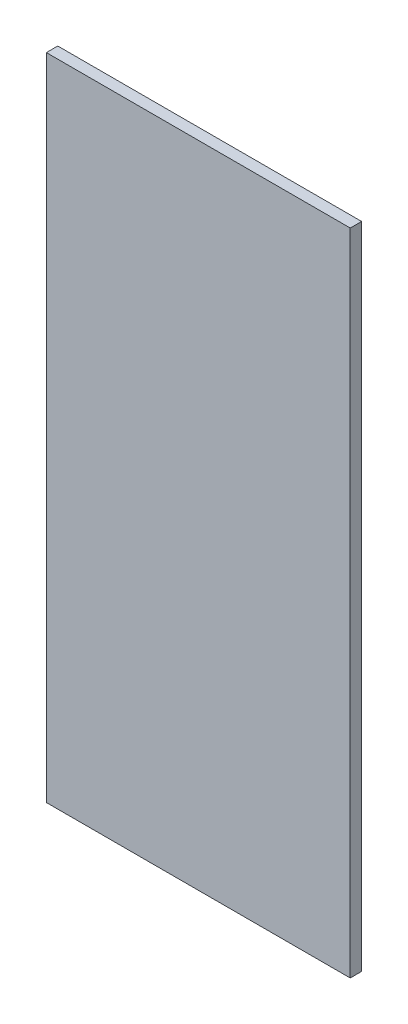
ISO-10303-21;
HEADER;
FILE_DESCRIPTION(('STEP AP214'),'2;1');
FILE_NAME('part.step','',(''),(''),'','','');
FILE_SCHEMA(('AUTOMOTIVE_DESIGN { 1 0 10303 214 1 1 1 1 }'));
ENDSEC;
DATA;
#1=APPLICATION_CONTEXT('core data for automotive mechanical design processes');
#2=APPLICATION_PROTOCOL_DEFINITION('international standard','automotive_design',2000,#1);
#3=PRODUCT_CONTEXT('',#1,'mechanical');
#4=PRODUCT('Part','Part','',(#3));
#5=PRODUCT_RELATED_PRODUCT_CATEGORY('part','',(#4));
#6=PRODUCT_DEFINITION_FORMATION('','',#4);
#7=PRODUCT_DEFINITION_CONTEXT('part definition',#1,'design');
#8=PRODUCT_DEFINITION('design','',#6,#7);
#9=PRODUCT_DEFINITION_SHAPE('','',#8);
#10=(LENGTH_UNIT() NAMED_UNIT(*) SI_UNIT(.MILLI.,.METRE.));
#11=(NAMED_UNIT(*) PLANE_ANGLE_UNIT() SI_UNIT($,.RADIAN.));
#12=(NAMED_UNIT(*) SI_UNIT($,.STERADIAN.) SOLID_ANGLE_UNIT());
#13=UNCERTAINTY_MEASURE_WITH_UNIT(LENGTH_MEASURE(1.E-05),#10,'distance_accuracy_value','');
#14=(GEOMETRIC_REPRESENTATION_CONTEXT(3) GLOBAL_UNCERTAINTY_ASSIGNED_CONTEXT((#13)) GLOBAL_UNIT_ASSIGNED_CONTEXT((#10,
#11,#12)) REPRESENTATION_CONTEXT('',''));
#15=CARTESIAN_POINT('',(0.,0.,0.));
#16=DIRECTION('',(0.,0.,1.));
#17=DIRECTION('',(1.,0.,0.));
#18=AXIS2_PLACEMENT_3D('',#15,#16,#17);
#19=CARTESIAN_POINT('',(-33.3720930232558,26.7441860465116,3.));
#20=DIRECTION('',(1.,0.,0.));
#21=DIRECTION('',(0.,1.,0.));
#22=AXIS2_PLACEMENT_3D('',#19,#20,#21);
#23=PLANE('',#22);
#24=DIRECTION('',(0.,-1.,0.));
#25=VECTOR('',#24,1.);
#26=CARTESIAN_POINT('',(-33.3720930232558,26.7441860465116,0.));
#27=LINE('',#26,#25);
#28=CARTESIAN_POINT('',(-33.3720930232558,26.7441860465116,0.));
#29=VERTEX_POINT('',#28);
#30=CARTESIAN_POINT('',(-33.3720930232558,-144.255813953488,0.));
#31=VERTEX_POINT('',#30);
#32=EDGE_CURVE('E107',#29,#31,#27,.T.);
#33=ORIENTED_EDGE('',*,*,#32,.T.);
#34=DIRECTION('',(0.,0.,-1.));
#35=VECTOR('',#34,1.);
#36=CARTESIAN_POINT('',(-33.3720930232558,-144.255813953488,3.));
#37=LINE('',#36,#35);
#38=CARTESIAN_POINT('',(-33.3720930232558,-144.255813953488,3.));
#39=VERTEX_POINT('',#38);
#40=EDGE_CURVE('E11',#39,#31,#37,.T.);
#41=ORIENTED_EDGE('',*,*,#40,.F.);
#42=DIRECTION('',(0.,-1.,0.));
#43=VECTOR('',#42,1.);
#44=CARTESIAN_POINT('',(-33.3720930232558,26.7441860465116,3.));
#45=LINE('',#44,#43);
#46=CARTESIAN_POINT('',(-33.3720930232558,26.7441860465116,3.));
#47=VERTEX_POINT('',#46);
#48=EDGE_CURVE('E91',#47,#39,#45,.T.);
#49=ORIENTED_EDGE('',*,*,#48,.F.);
#50=DIRECTION('',(0.,0.,-1.));
#51=VECTOR('',#50,1.);
#52=CARTESIAN_POINT('',(-33.3720930232558,26.7441860465116,3.));
#53=LINE('',#52,#51);
#54=EDGE_CURVE('E103',#47,#29,#53,.T.);
#55=ORIENTED_EDGE('',*,*,#54,.T.);
#56=EDGE_LOOP('',(#33,#41,#49,#55));
#57=FACE_BOUND('',#56,.T.);
#58=ADVANCED_FACE('F39',(#57),#23,.F.);
#59=CARTESIAN_POINT('',(-33.3720930232558,-144.255813953488,3.));
#60=DIRECTION('',(0.,1.,0.));
#61=DIRECTION('',(0.,0.,1.));
#62=AXIS2_PLACEMENT_3D('',#59,#60,#61);
#63=PLANE('',#62);
#64=DIRECTION('',(1.,0.,0.));
#65=VECTOR('',#64,1.);
#66=CARTESIAN_POINT('',(-33.3720930232558,-144.255813953488,0.));
#67=LINE('',#66,#65);
#68=CARTESIAN_POINT('',(46.6279069767442,-144.255813953488,0.));
#69=VERTEX_POINT('',#68);
#70=EDGE_CURVE('E96',#31,#69,#67,.T.);
#71=ORIENTED_EDGE('',*,*,#70,.T.);
#72=DIRECTION('',(0.,0.,-1.));
#73=VECTOR('',#72,1.);
#74=CARTESIAN_POINT('',(46.6279069767442,-144.255813953488,3.));
#75=LINE('',#74,#73);
#76=CARTESIAN_POINT('',(46.6279069767442,-144.255813953488,3.));
#77=VERTEX_POINT('',#76);
#78=EDGE_CURVE('E48',#77,#69,#75,.T.);
#79=ORIENTED_EDGE('',*,*,#78,.F.);
#80=DIRECTION('',(1.,0.,0.));
#81=VECTOR('',#80,1.);
#82=CARTESIAN_POINT('',(-33.3720930232558,-144.255813953488,3.));
#83=LINE('',#82,#81);
#84=EDGE_CURVE('E86',#39,#77,#83,.T.);
#85=ORIENTED_EDGE('',*,*,#84,.F.);
#86=ORIENTED_EDGE('',*,*,#40,.T.);
#87=EDGE_LOOP('',(#71,#79,#85,#86));
#88=FACE_BOUND('',#87,.T.);
#89=ADVANCED_FACE('F95',(#88),#63,.F.);
#90=CARTESIAN_POINT('',(46.6279069767442,26.7441860465116,3.));
#91=DIRECTION('',(-1.,0.,0.));
#92=DIRECTION('',(0.,-1.,0.));
#93=AXIS2_PLACEMENT_3D('',#90,#91,#92);
#94=PLANE('',#93);
#95=DIRECTION('',(0.,1.,0.));
#96=VECTOR('',#95,1.);
#97=CARTESIAN_POINT('',(46.6279069767442,26.7441860465116,0.));
#98=LINE('',#97,#96);
#99=CARTESIAN_POINT('',(46.6279069767442,26.7441860465116,0.));
#100=VERTEX_POINT('',#99);
#101=EDGE_CURVE('E73',#69,#100,#98,.T.);
#102=ORIENTED_EDGE('',*,*,#101,.T.);
#103=DIRECTION('',(0.,0.,-1.));
#104=VECTOR('',#103,1.);
#105=CARTESIAN_POINT('',(46.6279069767442,26.7441860465116,3.));
#106=LINE('',#105,#104);
#107=CARTESIAN_POINT('',(46.6279069767442,26.7441860465116,3.));
#108=VERTEX_POINT('',#107);
#109=EDGE_CURVE('E98',#108,#100,#106,.T.);
#110=ORIENTED_EDGE('',*,*,#109,.F.);
#111=DIRECTION('',(0.,1.,0.));
#112=VECTOR('',#111,1.);
#113=CARTESIAN_POINT('',(46.6279069767442,26.7441860465116,3.));
#114=LINE('',#113,#112);
#115=EDGE_CURVE('E89',#77,#108,#114,.T.);
#116=ORIENTED_EDGE('',*,*,#115,.F.);
#117=ORIENTED_EDGE('',*,*,#78,.T.);
#118=EDGE_LOOP('',(#102,#110,#116,#117));
#119=FACE_BOUND('',#118,.T.);
#120=ADVANCED_FACE('F99',(#119),#94,.F.);
#121=CARTESIAN_POINT('',(-33.3720930232558,26.7441860465116,3.));
#122=DIRECTION('',(0.,-1.,0.));
#123=DIRECTION('',(0.,0.,-1.));
#124=AXIS2_PLACEMENT_3D('',#121,#122,#123);
#125=PLANE('',#124);
#126=DIRECTION('',(-1.,0.,0.));
#127=VECTOR('',#126,1.);
#128=CARTESIAN_POINT('',(-33.3720930232558,26.7441860465116,0.));
#129=LINE('',#128,#127);
#130=EDGE_CURVE('E79',#100,#29,#129,.T.);
#131=ORIENTED_EDGE('',*,*,#130,.T.);
#132=ORIENTED_EDGE('',*,*,#54,.F.);
#133=DIRECTION('',(-1.,0.,0.));
#134=VECTOR('',#133,1.);
#135=CARTESIAN_POINT('',(-33.3720930232558,26.7441860465116,3.));
#136=LINE('',#135,#134);
#137=EDGE_CURVE('E56',#108,#47,#136,.T.);
#138=ORIENTED_EDGE('',*,*,#137,.F.);
#139=ORIENTED_EDGE('',*,*,#109,.T.);
#140=EDGE_LOOP('',(#131,#132,#138,#139));
#141=FACE_BOUND('',#140,.T.);
#142=ADVANCED_FACE('F120',(#141),#125,.F.);
#143=CARTESIAN_POINT('',(0.,0.,3.));
#144=DIRECTION('',(0.,0.,1.));
#145=DIRECTION('',(1.,0.,0.));
#146=AXIS2_PLACEMENT_3D('',#143,#144,#145);
#147=PLANE('',#146);
#148=ORIENTED_EDGE('',*,*,#48,.T.);
#149=ORIENTED_EDGE('',*,*,#84,.T.);
#150=ORIENTED_EDGE('',*,*,#115,.T.);
#151=ORIENTED_EDGE('',*,*,#137,.T.);
#152=EDGE_LOOP('',(#148,#149,#150,#151));
#153=FACE_BOUND('',#152,.T.);
#154=ADVANCED_FACE('F87',(#153),#147,.T.);
#155=CARTESIAN_POINT('',(0.,0.,0.));
#156=DIRECTION('',(0.,0.,1.));
#157=DIRECTION('',(1.,0.,0.));
#158=AXIS2_PLACEMENT_3D('',#155,#156,#157);
#159=PLANE('',#158);
#160=ORIENTED_EDGE('',*,*,#32,.F.);
#161=ORIENTED_EDGE('',*,*,#130,.F.);
#162=ORIENTED_EDGE('',*,*,#101,.F.);
#163=ORIENTED_EDGE('',*,*,#70,.F.);
#164=EDGE_LOOP('',(#160,#161,#162,#163));
#165=FACE_BOUND('',#164,.T.);
#166=ADVANCED_FACE('F123',(#165),#159,.F.);
#167=CLOSED_SHELL('',(#58,#89,#120,#142,#154,#166));
#168=MANIFOLD_SOLID_BREP('B2',#167);
#169=ADVANCED_BREP_SHAPE_REPRESENTATION('',(#18,#168),#14);
#170=SHAPE_DEFINITION_REPRESENTATION(#9,#169);
ENDSEC;
END-ISO-10303-21;
